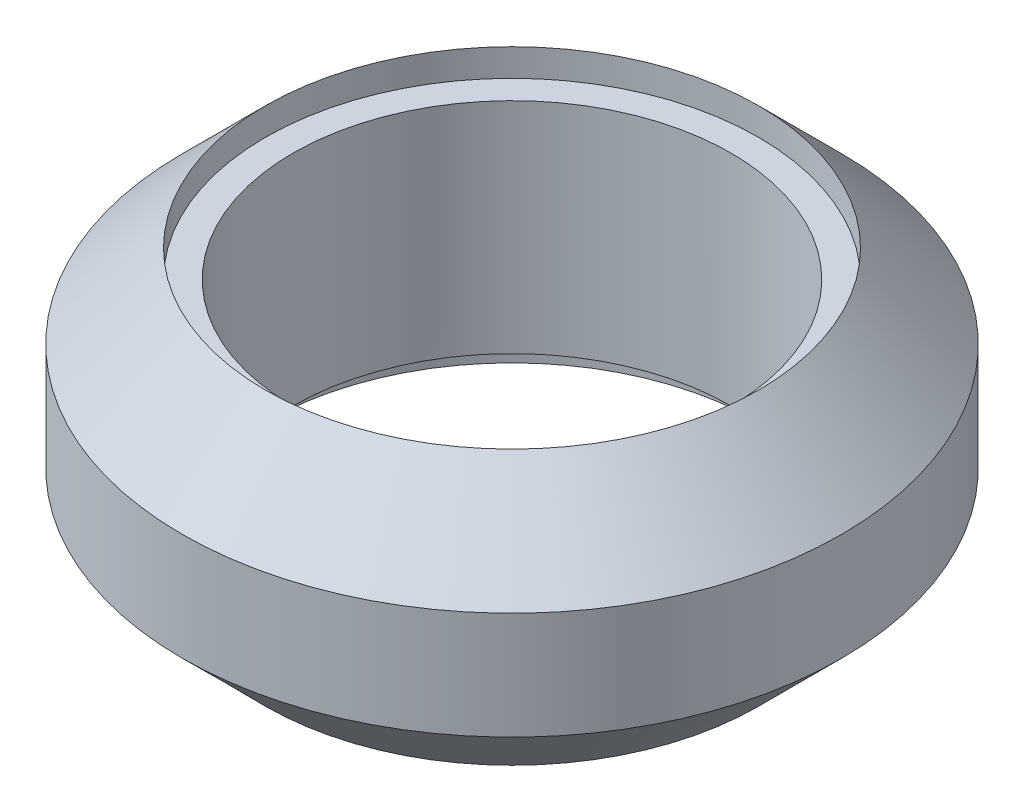
ISO-10303-21;
HEADER;
FILE_DESCRIPTION(('STEP AP214'),'2;1');
FILE_NAME('part.step','',(''),(''),'','','');
FILE_SCHEMA(('AUTOMOTIVE_DESIGN { 1 0 10303 214 1 1 1 1 }'));
ENDSEC;
DATA;
#1=APPLICATION_CONTEXT('core data for automotive mechanical design processes');
#2=APPLICATION_PROTOCOL_DEFINITION('international standard','automotive_design',2000,#1);
#3=PRODUCT_CONTEXT('',#1,'mechanical');
#4=PRODUCT('Part','Part','',(#3));
#5=PRODUCT_RELATED_PRODUCT_CATEGORY('part','',(#4));
#6=PRODUCT_DEFINITION_FORMATION('','',#4);
#7=PRODUCT_DEFINITION_CONTEXT('part definition',#1,'design');
#8=PRODUCT_DEFINITION('design','',#6,#7);
#9=PRODUCT_DEFINITION_SHAPE('','',#8);
#10=(LENGTH_UNIT() NAMED_UNIT(*) SI_UNIT(.MILLI.,.METRE.));
#11=(NAMED_UNIT(*) PLANE_ANGLE_UNIT() SI_UNIT($,.RADIAN.));
#12=(NAMED_UNIT(*) SI_UNIT($,.STERADIAN.) SOLID_ANGLE_UNIT());
#13=UNCERTAINTY_MEASURE_WITH_UNIT(LENGTH_MEASURE(1.E-05),#10,'distance_accuracy_value','');
#14=(GEOMETRIC_REPRESENTATION_CONTEXT(3) GLOBAL_UNCERTAINTY_ASSIGNED_CONTEXT((#13)) GLOBAL_UNIT_ASSIGNED_CONTEXT((#10,
#11,#12)) REPRESENTATION_CONTEXT('',''));
#15=CARTESIAN_POINT('',(0.,0.,0.));
#16=DIRECTION('',(0.,0.,1.));
#17=DIRECTION('',(1.,0.,0.));
#18=AXIS2_PLACEMENT_3D('',#15,#16,#17);
#19=CARTESIAN_POINT('',(0.,0.,0.));
#20=DIRECTION('',(0.,1.,0.));
#21=DIRECTION('',(0.,0.,1.));
#22=AXIS2_PLACEMENT_3D('',#19,#20,#21);
#23=CYLINDRICAL_SURFACE('',#22,8.);
#24=CARTESIAN_POINT('',(0.,1.,0.));
#25=DIRECTION('',(0.,-1.,0.));
#26=DIRECTION('',(0.,0.,-1.));
#27=AXIS2_PLACEMENT_3D('',#24,#25,#26);
#28=CIRCLE('',#27,8.);
#29=CARTESIAN_POINT('',(0.,1.,-8.));
#30=VERTEX_POINT('',#29);
#31=EDGE_CURVE('E57',#30,#30,#28,.T.);
#32=ORIENTED_EDGE('',*,*,#31,.T.);
#33=EDGE_LOOP('',(#32));
#34=FACE_BOUND('',#33,.T.);
#35=CARTESIAN_POINT('',(0.,9.,0.));
#36=DIRECTION('',(0.,1.,0.));
#37=DIRECTION('',(0.,0.,1.));
#38=AXIS2_PLACEMENT_3D('',#35,#36,#37);
#39=CIRCLE('',#38,8.);
#40=CARTESIAN_POINT('',(0.,9.,8.));
#41=VERTEX_POINT('',#40);
#42=EDGE_CURVE('E65',#41,#41,#39,.T.);
#43=ORIENTED_EDGE('',*,*,#42,.T.);
#44=EDGE_LOOP('',(#43));
#45=FACE_BOUND('',#44,.T.);
#46=ADVANCED_FACE('F38',(#34,#45),#23,.F.);
#47=CARTESIAN_POINT('',(0.,6.95944084089782,0.));
#48=DIRECTION('',(0.,-1.,0.));
#49=DIRECTION('',(-1.,0.,0.));
#50=AXIS2_PLACEMENT_3D('',#47,#48,#49);
#51=CONICAL_SURFACE('',#50,12.0405591591021,0.78539816339745);
#52=CARTESIAN_POINT('',(0.,10.,0.));
#53=DIRECTION('',(0.,1.,0.));
#54=DIRECTION('',(0.,0.,1.));
#55=AXIS2_PLACEMENT_3D('',#52,#53,#54);
#56=CIRCLE('',#55,8.99999999999999);
#57=CARTESIAN_POINT('',(0.,10.,8.99999999999999));
#58=VERTEX_POINT('',#57);
#59=EDGE_CURVE('E62',#58,#58,#56,.T.);
#60=ORIENTED_EDGE('',*,*,#59,.F.);
#61=EDGE_LOOP('',(#60));
#62=FACE_BOUND('',#61,.T.);
#63=CARTESIAN_POINT('',(0.,6.95944084089782,0.));
#64=DIRECTION('',(0.,-1.,0.));
#65=DIRECTION('',(0.,0.,-1.));
#66=AXIS2_PLACEMENT_3D('',#63,#64,#65);
#67=CIRCLE('',#66,12.0405591591021);
#68=CARTESIAN_POINT('',(0.,6.95944084089782,-12.0405591591021));
#69=VERTEX_POINT('',#68);
#70=EDGE_CURVE('E45',#69,#69,#67,.T.);
#71=ORIENTED_EDGE('',*,*,#70,.F.);
#72=EDGE_LOOP('',(#71));
#73=FACE_BOUND('',#72,.T.);
#74=ADVANCED_FACE('F40',(#62,#73),#51,.T.);
#75=CARTESIAN_POINT('',(0.,-31.0152849636135,0.));
#76=DIRECTION('',(0.,1.,0.));
#77=DIRECTION('',(0.,0.,1.));
#78=AXIS2_PLACEMENT_3D('',#75,#76,#77);
#79=CYLINDRICAL_SURFACE('',#78,12.0405591591021);
#80=ORIENTED_EDGE('',*,*,#70,.T.);
#81=EDGE_LOOP('',(#80));
#82=FACE_BOUND('',#81,.T.);
#83=CARTESIAN_POINT('',(0.,3.04055915910215,0.));
#84=DIRECTION('',(0.,-1.,0.));
#85=DIRECTION('',(0.,0.,-1.));
#86=AXIS2_PLACEMENT_3D('',#83,#84,#85);
#87=CIRCLE('',#86,12.0405591591021);
#88=CARTESIAN_POINT('',(0.,3.04055915910215,-12.0405591591021));
#89=VERTEX_POINT('',#88);
#90=EDGE_CURVE('E10',#89,#89,#87,.T.);
#91=ORIENTED_EDGE('',*,*,#90,.F.);
#92=EDGE_LOOP('',(#91));
#93=FACE_BOUND('',#92,.T.);
#94=ADVANCED_FACE('F87',(#82,#93),#79,.T.);
#95=CARTESIAN_POINT('',(0.,3.04055915910215,0.));
#96=DIRECTION('',(0.,1.,0.));
#97=DIRECTION('',(0.,0.,-1.));
#98=AXIS2_PLACEMENT_3D('',#95,#96,#97);
#99=CONICAL_SURFACE('',#98,12.0405591591022,0.78539816339745);
#100=CARTESIAN_POINT('',(0.,0.,0.));
#101=DIRECTION('',(0.,-1.,0.));
#102=DIRECTION('',(0.,0.,-1.));
#103=AXIS2_PLACEMENT_3D('',#100,#101,#102);
#104=CIRCLE('',#103,9.);
#105=CARTESIAN_POINT('',(0.,0.,-9.));
#106=VERTEX_POINT('',#105);
#107=EDGE_CURVE('E53',#106,#106,#104,.T.);
#108=ORIENTED_EDGE('',*,*,#107,.F.);
#109=EDGE_LOOP('',(#108));
#110=FACE_BOUND('',#109,.T.);
#111=ORIENTED_EDGE('',*,*,#90,.T.);
#112=EDGE_LOOP('',(#111));
#113=FACE_BOUND('',#112,.T.);
#114=ADVANCED_FACE('F92',(#110,#113),#99,.T.);
#115=CARTESIAN_POINT('',(0.,1.,0.));
#116=DIRECTION('',(0.,-1.,0.));
#117=DIRECTION('',(0.,0.,-1.));
#118=AXIS2_PLACEMENT_3D('',#115,#116,#117);
#119=CYLINDRICAL_SURFACE('',#118,9.);
#120=CARTESIAN_POINT('',(0.,1.,0.));
#121=DIRECTION('',(0.,-1.,0.));
#122=DIRECTION('',(0.,0.,-1.));
#123=AXIS2_PLACEMENT_3D('',#120,#121,#122);
#124=CIRCLE('',#123,9.);
#125=CARTESIAN_POINT('',(0.,1.,-9.));
#126=VERTEX_POINT('',#125);
#127=EDGE_CURVE('E49',#126,#126,#124,.T.);
#128=ORIENTED_EDGE('',*,*,#127,.F.);
#129=EDGE_LOOP('',(#128));
#130=FACE_BOUND('',#129,.T.);
#131=ORIENTED_EDGE('',*,*,#107,.T.);
#132=EDGE_LOOP('',(#131));
#133=FACE_BOUND('',#132,.T.);
#134=ADVANCED_FACE('F99',(#130,#133),#119,.F.);
#135=CARTESIAN_POINT('',(0.,1.,0.));
#136=DIRECTION('',(0.,-1.,0.));
#137=DIRECTION('',(0.,0.,-1.));
#138=AXIS2_PLACEMENT_3D('',#135,#136,#137);
#139=PLANE('',#138);
#140=ORIENTED_EDGE('',*,*,#31,.F.);
#141=EDGE_LOOP('',(#140));
#142=FACE_BOUND('',#141,.T.);
#143=ORIENTED_EDGE('',*,*,#127,.T.);
#144=EDGE_LOOP('',(#143));
#145=FACE_BOUND('',#144,.T.);
#146=ADVANCED_FACE('F81',(#142,#145),#139,.T.);
#147=CARTESIAN_POINT('',(0.,9.,0.));
#148=DIRECTION('',(0.,1.,0.));
#149=DIRECTION('',(0.,0.,1.));
#150=AXIS2_PLACEMENT_3D('',#147,#148,#149);
#151=CYLINDRICAL_SURFACE('',#150,8.99999999999999);
#152=CARTESIAN_POINT('',(0.,9.,0.));
#153=DIRECTION('',(0.,1.,0.));
#154=DIRECTION('',(0.,0.,1.));
#155=AXIS2_PLACEMENT_3D('',#152,#153,#154);
#156=CIRCLE('',#155,8.99999999999999);
#157=CARTESIAN_POINT('',(0.,9.,8.99999999999999));
#158=VERTEX_POINT('',#157);
#159=EDGE_CURVE('E61',#158,#158,#156,.T.);
#160=ORIENTED_EDGE('',*,*,#159,.F.);
#161=EDGE_LOOP('',(#160));
#162=FACE_BOUND('',#161,.T.);
#163=ORIENTED_EDGE('',*,*,#59,.T.);
#164=EDGE_LOOP('',(#163));
#165=FACE_BOUND('',#164,.T.);
#166=ADVANCED_FACE('F75',(#162,#165),#151,.F.);
#167=CARTESIAN_POINT('',(0.,9.,0.));
#168=DIRECTION('',(0.,1.,0.));
#169=DIRECTION('',(0.,0.,1.));
#170=AXIS2_PLACEMENT_3D('',#167,#168,#169);
#171=PLANE('',#170);
#172=ORIENTED_EDGE('',*,*,#42,.F.);
#173=EDGE_LOOP('',(#172));
#174=FACE_BOUND('',#173,.T.);
#175=ORIENTED_EDGE('',*,*,#159,.T.);
#176=EDGE_LOOP('',(#175));
#177=FACE_BOUND('',#176,.T.);
#178=ADVANCED_FACE('F72',(#174,#177),#171,.T.);
#179=CLOSED_SHELL('',(#46,#74,#94,#114,#134,#146,#166,#178));
#180=MANIFOLD_SOLID_BREP('B2',#179);
#181=ADVANCED_BREP_SHAPE_REPRESENTATION('',(#18,#180),#14);
#182=SHAPE_DEFINITION_REPRESENTATION(#9,#181);
ENDSEC;
END-ISO-10303-21;
